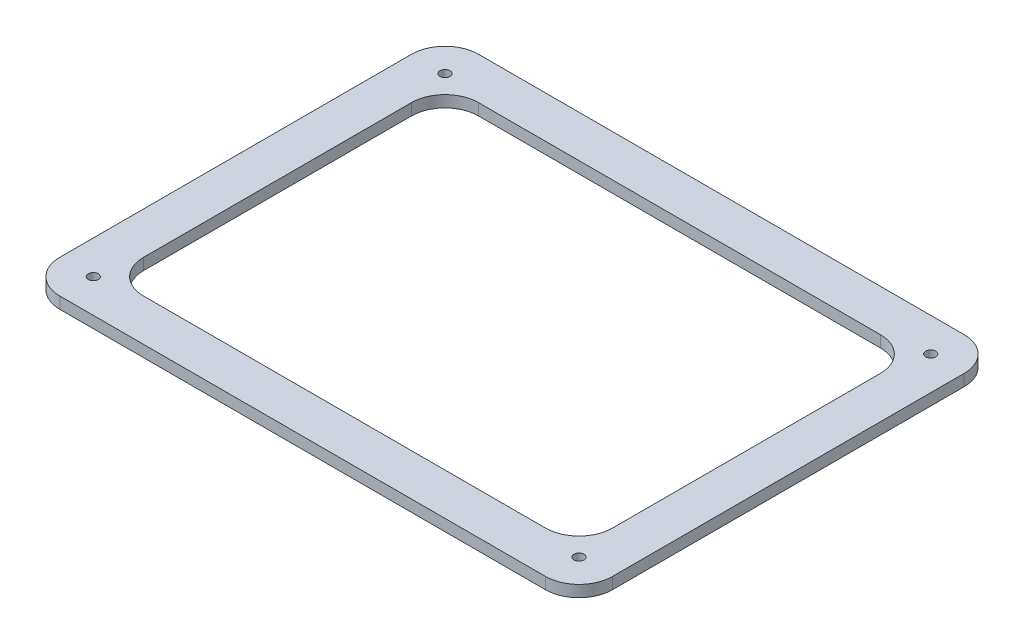
ISO-10303-21;
HEADER;
FILE_DESCRIPTION(('STEP AP214'),'2;1');
FILE_NAME('part.step','',(''),(''),'','','');
FILE_SCHEMA(('AUTOMOTIVE_DESIGN { 1 0 10303 214 1 1 1 1 }'));
ENDSEC;
DATA;
#1=APPLICATION_CONTEXT('core data for automotive mechanical design processes');
#2=APPLICATION_PROTOCOL_DEFINITION('international standard','automotive_design',2000,#1);
#3=PRODUCT_CONTEXT('',#1,'mechanical');
#4=PRODUCT('Part','Part','',(#3));
#5=PRODUCT_RELATED_PRODUCT_CATEGORY('part','',(#4));
#6=PRODUCT_DEFINITION_FORMATION('','',#4);
#7=PRODUCT_DEFINITION_CONTEXT('part definition',#1,'design');
#8=PRODUCT_DEFINITION('design','',#6,#7);
#9=PRODUCT_DEFINITION_SHAPE('','',#8);
#10=(LENGTH_UNIT() NAMED_UNIT(*) SI_UNIT(.MILLI.,.METRE.));
#11=(NAMED_UNIT(*) PLANE_ANGLE_UNIT() SI_UNIT($,.RADIAN.));
#12=(NAMED_UNIT(*) SI_UNIT($,.STERADIAN.) SOLID_ANGLE_UNIT());
#13=UNCERTAINTY_MEASURE_WITH_UNIT(LENGTH_MEASURE(1.E-05),#10,'distance_accuracy_value','');
#14=(GEOMETRIC_REPRESENTATION_CONTEXT(3) GLOBAL_UNCERTAINTY_ASSIGNED_CONTEXT((#13)) GLOBAL_UNIT_ASSIGNED_CONTEXT((#10,
#11,#12)) REPRESENTATION_CONTEXT('',''));
#15=CARTESIAN_POINT('',(0.,0.,0.));
#16=DIRECTION('',(0.,0.,1.));
#17=DIRECTION('',(1.,0.,0.));
#18=AXIS2_PLACEMENT_3D('',#15,#16,#17);
#19=CARTESIAN_POINT('',(-165.,6.9,125.));
#20=DIRECTION('',(1.,0.,0.));
#21=DIRECTION('',(0.,0.,-1.));
#22=AXIS2_PLACEMENT_3D('',#19,#20,#21);
#23=PLANE('',#22);
#24=DIRECTION('',(0.,0.,1.));
#25=VECTOR('',#24,1.);
#26=CARTESIAN_POINT('',(-165.,6.9,125.));
#27=LINE('',#26,#25);
#28=CARTESIAN_POINT('',(-165.,6.9,-105.));
#29=VERTEX_POINT('',#28);
#30=CARTESIAN_POINT('',(-165.,6.9,105.));
#31=VERTEX_POINT('',#30);
#32=EDGE_CURVE('E183',#29,#31,#27,.T.);
#33=ORIENTED_EDGE('',*,*,#32,.F.);
#34=DIRECTION('',(0.,-1.,0.));
#35=VECTOR('',#34,1.);
#36=CARTESIAN_POINT('',(-165.,6.9,-105.));
#37=LINE('',#36,#35);
#38=CARTESIAN_POINT('',(-165.,0.,-105.));
#39=VERTEX_POINT('',#38);
#40=EDGE_CURVE('E224',#29,#39,#37,.T.);
#41=ORIENTED_EDGE('',*,*,#40,.T.);
#42=DIRECTION('',(0.,0.,1.));
#43=VECTOR('',#42,1.);
#44=CARTESIAN_POINT('',(-165.,0.,125.));
#45=LINE('',#44,#43);
#46=CARTESIAN_POINT('',(-165.,0.,105.));
#47=VERTEX_POINT('',#46);
#48=EDGE_CURVE('E355',#39,#47,#45,.T.);
#49=ORIENTED_EDGE('',*,*,#48,.T.);
#50=DIRECTION('',(0.,-1.,0.));
#51=VECTOR('',#50,1.);
#52=CARTESIAN_POINT('',(-165.,6.9,105.));
#53=LINE('',#52,#51);
#54=EDGE_CURVE('E221',#47,#31,#53,.F.);
#55=ORIENTED_EDGE('',*,*,#54,.T.);
#56=EDGE_LOOP('',(#33,#41,#49,#55));
#57=FACE_BOUND('',#56,.T.);
#58=ADVANCED_FACE('F39',(#57),#23,.F.);
#59=CARTESIAN_POINT('',(-165.,6.9,125.));
#60=DIRECTION('',(0.,0.,-1.));
#61=DIRECTION('',(-1.,0.,0.));
#62=AXIS2_PLACEMENT_3D('',#59,#60,#61);
#63=PLANE('',#62);
#64=DIRECTION('',(1.,0.,0.));
#65=VECTOR('',#64,1.);
#66=CARTESIAN_POINT('',(-165.,6.9,125.));
#67=LINE('',#66,#65);
#68=CARTESIAN_POINT('',(-145.,6.9,125.));
#69=VERTEX_POINT('',#68);
#70=CARTESIAN_POINT('',(145.,6.9,125.));
#71=VERTEX_POINT('',#70);
#72=EDGE_CURVE('E189',#69,#71,#67,.T.);
#73=ORIENTED_EDGE('',*,*,#72,.F.);
#74=DIRECTION('',(0.,-1.,0.));
#75=VECTOR('',#74,1.);
#76=CARTESIAN_POINT('',(-145.,6.9,125.));
#77=LINE('',#76,#75);
#78=CARTESIAN_POINT('',(-145.,0.,125.));
#79=VERTEX_POINT('',#78);
#80=EDGE_CURVE('E231',#69,#79,#77,.T.);
#81=ORIENTED_EDGE('',*,*,#80,.T.);
#82=DIRECTION('',(1.,0.,0.));
#83=VECTOR('',#82,1.);
#84=CARTESIAN_POINT('',(-165.,0.,125.));
#85=LINE('',#84,#83);
#86=CARTESIAN_POINT('',(145.,0.,125.));
#87=VERTEX_POINT('',#86);
#88=EDGE_CURVE('E191',#79,#87,#85,.T.);
#89=ORIENTED_EDGE('',*,*,#88,.T.);
#90=DIRECTION('',(0.,-1.,0.));
#91=VECTOR('',#90,1.);
#92=CARTESIAN_POINT('',(145.,6.9,125.));
#93=LINE('',#92,#91);
#94=EDGE_CURVE('E228',#87,#71,#93,.F.);
#95=ORIENTED_EDGE('',*,*,#94,.T.);
#96=EDGE_LOOP('',(#73,#81,#89,#95));
#97=FACE_BOUND('',#96,.T.);
#98=ADVANCED_FACE('F376',(#97),#63,.F.);
#99=CARTESIAN_POINT('',(165.,6.9,125.));
#100=DIRECTION('',(-1.,0.,0.));
#101=DIRECTION('',(0.,0.,1.));
#102=AXIS2_PLACEMENT_3D('',#99,#100,#101);
#103=PLANE('',#102);
#104=DIRECTION('',(0.,0.,-1.));
#105=VECTOR('',#104,1.);
#106=CARTESIAN_POINT('',(165.,0.,125.));
#107=LINE('',#106,#105);
#108=CARTESIAN_POINT('',(165.,0.,105.));
#109=VERTEX_POINT('',#108);
#110=CARTESIAN_POINT('',(165.,0.,-105.));
#111=VERTEX_POINT('',#110);
#112=EDGE_CURVE('E184',#109,#111,#107,.T.);
#113=ORIENTED_EDGE('',*,*,#112,.T.);
#114=DIRECTION('',(0.,-1.,0.));
#115=VECTOR('',#114,1.);
#116=CARTESIAN_POINT('',(165.,6.9,-105.));
#117=LINE('',#116,#115);
#118=CARTESIAN_POINT('',(165.,6.9,-105.));
#119=VERTEX_POINT('',#118);
#120=EDGE_CURVE('E159',#111,#119,#117,.F.);
#121=ORIENTED_EDGE('',*,*,#120,.T.);
#122=DIRECTION('',(0.,0.,-1.));
#123=VECTOR('',#122,1.);
#124=CARTESIAN_POINT('',(165.,6.9,125.));
#125=LINE('',#124,#123);
#126=CARTESIAN_POINT('',(165.,6.9,105.));
#127=VERTEX_POINT('',#126);
#128=EDGE_CURVE('E362',#127,#119,#125,.T.);
#129=ORIENTED_EDGE('',*,*,#128,.F.);
#130=DIRECTION('',(0.,-1.,0.));
#131=VECTOR('',#130,1.);
#132=CARTESIAN_POINT('',(165.,6.9,105.));
#133=LINE('',#132,#131);
#134=EDGE_CURVE('E165',#127,#109,#133,.T.);
#135=ORIENTED_EDGE('',*,*,#134,.T.);
#136=EDGE_LOOP('',(#113,#121,#129,#135));
#137=FACE_BOUND('',#136,.T.);
#138=ADVANCED_FACE('F385',(#137),#103,.F.);
#139=CARTESIAN_POINT('',(-165.,6.9,-125.));
#140=DIRECTION('',(0.,0.,1.));
#141=DIRECTION('',(1.,0.,0.));
#142=AXIS2_PLACEMENT_3D('',#139,#140,#141);
#143=PLANE('',#142);
#144=DIRECTION('',(-1.,0.,0.));
#145=VECTOR('',#144,1.);
#146=CARTESIAN_POINT('',(-165.,6.9,-125.));
#147=LINE('',#146,#145);
#148=CARTESIAN_POINT('',(145.,6.9,-125.));
#149=VERTEX_POINT('',#148);
#150=CARTESIAN_POINT('',(-145.,6.9,-125.));
#151=VERTEX_POINT('',#150);
#152=EDGE_CURVE('E175',#149,#151,#147,.T.);
#153=ORIENTED_EDGE('',*,*,#152,.F.);
#154=DIRECTION('',(0.,-1.,0.));
#155=VECTOR('',#154,1.);
#156=CARTESIAN_POINT('',(145.,6.9,-125.));
#157=LINE('',#156,#155);
#158=CARTESIAN_POINT('',(145.,0.,-125.));
#159=VERTEX_POINT('',#158);
#160=EDGE_CURVE('E158',#149,#159,#157,.T.);
#161=ORIENTED_EDGE('',*,*,#160,.T.);
#162=DIRECTION('',(-1.,0.,0.));
#163=VECTOR('',#162,1.);
#164=CARTESIAN_POINT('',(-165.,0.,-125.));
#165=LINE('',#164,#163);
#166=CARTESIAN_POINT('',(-145.,0.,-125.));
#167=VERTEX_POINT('',#166);
#168=EDGE_CURVE('E172',#159,#167,#165,.T.);
#169=ORIENTED_EDGE('',*,*,#168,.T.);
#170=DIRECTION('',(0.,-1.,0.));
#171=VECTOR('',#170,1.);
#172=CARTESIAN_POINT('',(-145.,6.9,-125.));
#173=LINE('',#172,#171);
#174=EDGE_CURVE('E178',#167,#151,#173,.F.);
#175=ORIENTED_EDGE('',*,*,#174,.T.);
#176=EDGE_LOOP('',(#153,#161,#169,#175));
#177=FACE_BOUND('',#176,.T.);
#178=ADVANCED_FACE('F171',(#177),#143,.F.);
#179=CARTESIAN_POINT('',(0.,6.9,0.));
#180=DIRECTION('',(0.,-1.,0.));
#181=DIRECTION('',(0.,0.,-1.));
#182=AXIS2_PLACEMENT_3D('',#179,#180,#181);
#183=PLANE('',#182);
#184=DIRECTION('',(1.,0.,0.));
#185=VECTOR('',#184,1.);
#186=CARTESIAN_POINT('',(-140.,6.9,100.));
#187=LINE('',#186,#185);
#188=CARTESIAN_POINT('',(-120.,6.9,100.));
#189=VERTEX_POINT('',#188);
#190=CARTESIAN_POINT('',(120.,6.9,100.));
#191=VERTEX_POINT('',#190);
#192=EDGE_CURVE('E320',#189,#191,#187,.T.);
#193=ORIENTED_EDGE('',*,*,#192,.F.);
#194=CARTESIAN_POINT('',(-120.,6.9,80.));
#195=DIRECTION('',(0.,-1.,0.));
#196=DIRECTION('',(0.,0.,-1.));
#197=AXIS2_PLACEMENT_3D('',#194,#195,#196);
#198=CIRCLE('',#197,20.);
#199=CARTESIAN_POINT('',(-140.,6.9,80.));
#200=VERTEX_POINT('',#199);
#201=EDGE_CURVE('E262',#189,#200,#198,.T.);
#202=ORIENTED_EDGE('',*,*,#201,.T.);
#203=DIRECTION('',(0.,0.,1.));
#204=VECTOR('',#203,1.);
#205=CARTESIAN_POINT('',(-140.,6.9,-100.));
#206=LINE('',#205,#204);
#207=CARTESIAN_POINT('',(-140.,6.9,-80.));
#208=VERTEX_POINT('',#207);
#209=EDGE_CURVE('E287',#208,#200,#206,.T.);
#210=ORIENTED_EDGE('',*,*,#209,.F.);
#211=CARTESIAN_POINT('',(-120.,6.9,-80.));
#212=DIRECTION('',(0.,-1.,0.));
#213=DIRECTION('',(0.,0.,-1.));
#214=AXIS2_PLACEMENT_3D('',#211,#212,#213);
#215=CIRCLE('',#214,20.);
#216=CARTESIAN_POINT('',(-120.,6.9,-100.));
#217=VERTEX_POINT('',#216);
#218=EDGE_CURVE('E48',#208,#217,#215,.T.);
#219=ORIENTED_EDGE('',*,*,#218,.T.);
#220=DIRECTION('',(-1.,0.,0.));
#221=VECTOR('',#220,1.);
#222=CARTESIAN_POINT('',(-140.,6.9,-100.));
#223=LINE('',#222,#221);
#224=CARTESIAN_POINT('',(120.,6.9,-100.));
#225=VERTEX_POINT('',#224);
#226=EDGE_CURVE('E285',#225,#217,#223,.T.);
#227=ORIENTED_EDGE('',*,*,#226,.F.);
#228=CARTESIAN_POINT('',(120.,6.9,-80.0000000000001));
#229=DIRECTION('',(0.,-1.,0.));
#230=DIRECTION('',(0.,0.,-1.));
#231=AXIS2_PLACEMENT_3D('',#228,#229,#230);
#232=CIRCLE('',#231,20.);
#233=CARTESIAN_POINT('',(140.,6.9,-80.0000000000001));
#234=VERTEX_POINT('',#233);
#235=EDGE_CURVE('E274',#225,#234,#232,.T.);
#236=ORIENTED_EDGE('',*,*,#235,.T.);
#237=DIRECTION('',(0.,0.,-1.));
#238=VECTOR('',#237,1.);
#239=CARTESIAN_POINT('',(140.,6.9,-100.));
#240=LINE('',#239,#238);
#241=CARTESIAN_POINT('',(140.,6.9,80.));
#242=VERTEX_POINT('',#241);
#243=EDGE_CURVE('E294',#242,#234,#240,.T.);
#244=ORIENTED_EDGE('',*,*,#243,.F.);
#245=CARTESIAN_POINT('',(120.,6.9,80.));
#246=DIRECTION('',(0.,-1.,0.));
#247=DIRECTION('',(0.,0.,-1.));
#248=AXIS2_PLACEMENT_3D('',#245,#246,#247);
#249=CIRCLE('',#248,20.);
#250=EDGE_CURVE('E268',#242,#191,#249,.T.);
#251=ORIENTED_EDGE('',*,*,#250,.T.);
#252=EDGE_LOOP('',(#193,#202,#210,#219,#227,#236,#244,#251));
#253=FACE_BOUND('',#252,.T.);
#254=CARTESIAN_POINT('',(-145.,6.9,105.));
#255=DIRECTION('',(0.,1.,0.));
#256=DIRECTION('',(0.,0.,1.));
#257=AXIS2_PLACEMENT_3D('',#254,#255,#256);
#258=CIRCLE('',#257,2.99999999999999);
#259=CARTESIAN_POINT('',(-145.,6.9,108.));
#260=VERTEX_POINT('',#259);
#261=EDGE_CURVE('E317',#260,#260,#258,.T.);
#262=ORIENTED_EDGE('',*,*,#261,.F.);
#263=EDGE_LOOP('',(#262));
#264=FACE_BOUND('',#263,.T.);
#265=CARTESIAN_POINT('',(145.,6.9,105.));
#266=DIRECTION('',(0.,1.,0.));
#267=DIRECTION('',(0.,0.,1.));
#268=AXIS2_PLACEMENT_3D('',#265,#266,#267);
#269=CIRCLE('',#268,2.99999999999999);
#270=CARTESIAN_POINT('',(145.,6.9,108.));
#271=VERTEX_POINT('',#270);
#272=EDGE_CURVE('E340',#271,#271,#269,.T.);
#273=ORIENTED_EDGE('',*,*,#272,.F.);
#274=EDGE_LOOP('',(#273));
#275=FACE_BOUND('',#274,.T.);
#276=CARTESIAN_POINT('',(145.,6.9,-105.));
#277=DIRECTION('',(0.,1.,0.));
#278=DIRECTION('',(0.,0.,1.));
#279=AXIS2_PLACEMENT_3D('',#276,#277,#278);
#280=CIRCLE('',#279,2.99999999999999);
#281=CARTESIAN_POINT('',(145.,6.9,-102.));
#282=VERTEX_POINT('',#281);
#283=EDGE_CURVE('E332',#282,#282,#280,.T.);
#284=ORIENTED_EDGE('',*,*,#283,.F.);
#285=EDGE_LOOP('',(#284));
#286=FACE_BOUND('',#285,.T.);
#287=CARTESIAN_POINT('',(-145.,6.9,-105.));
#288=DIRECTION('',(0.,1.,0.));
#289=DIRECTION('',(0.,0.,1.));
#290=AXIS2_PLACEMENT_3D('',#287,#288,#289);
#291=CIRCLE('',#290,2.99999999999999);
#292=CARTESIAN_POINT('',(-145.,6.9,-102.));
#293=VERTEX_POINT('',#292);
#294=EDGE_CURVE('E331',#293,#293,#291,.T.);
#295=ORIENTED_EDGE('',*,*,#294,.F.);
#296=EDGE_LOOP('',(#295));
#297=FACE_BOUND('',#296,.T.);
#298=ORIENTED_EDGE('',*,*,#128,.T.);
#299=CARTESIAN_POINT('',(145.,6.9,-105.));
#300=DIRECTION('',(0.,-1.,0.));
#301=DIRECTION('',(0.,0.,-1.));
#302=AXIS2_PLACEMENT_3D('',#299,#300,#301);
#303=CIRCLE('',#302,20.);
#304=EDGE_CURVE('E218',#119,#149,#303,.F.);
#305=ORIENTED_EDGE('',*,*,#304,.T.);
#306=ORIENTED_EDGE('',*,*,#152,.T.);
#307=CARTESIAN_POINT('',(-145.,6.9,-105.));
#308=DIRECTION('',(0.,-1.,0.));
#309=DIRECTION('',(0.,0.,-1.));
#310=AXIS2_PLACEMENT_3D('',#307,#308,#309);
#311=CIRCLE('',#310,20.);
#312=EDGE_CURVE('E215',#151,#29,#311,.F.);
#313=ORIENTED_EDGE('',*,*,#312,.T.);
#314=ORIENTED_EDGE('',*,*,#32,.T.);
#315=CARTESIAN_POINT('',(-145.,6.9,105.));
#316=DIRECTION('',(0.,-1.,0.));
#317=DIRECTION('',(0.,0.,-1.));
#318=AXIS2_PLACEMENT_3D('',#315,#316,#317);
#319=CIRCLE('',#318,20.);
#320=EDGE_CURVE('E212',#31,#69,#319,.F.);
#321=ORIENTED_EDGE('',*,*,#320,.T.);
#322=ORIENTED_EDGE('',*,*,#72,.T.);
#323=CARTESIAN_POINT('',(145.,6.9,105.));
#324=DIRECTION('',(0.,-1.,0.));
#325=DIRECTION('',(0.,0.,-1.));
#326=AXIS2_PLACEMENT_3D('',#323,#324,#325);
#327=CIRCLE('',#326,20.);
#328=EDGE_CURVE('E209',#71,#127,#327,.F.);
#329=ORIENTED_EDGE('',*,*,#328,.T.);
#330=EDGE_LOOP('',(#298,#305,#306,#313,#314,#321,#322,#329));
#331=FACE_BOUND('',#330,.T.);
#332=ADVANCED_FACE('F283',(#253,#264,#275,#286,#297,#331),#183,.F.);
#333=CARTESIAN_POINT('',(0.,0.,0.));
#334=DIRECTION('',(0.,-1.,0.));
#335=DIRECTION('',(0.,0.,-1.));
#336=AXIS2_PLACEMENT_3D('',#333,#334,#335);
#337=PLANE('',#336);
#338=DIRECTION('',(-1.,0.,0.));
#339=VECTOR('',#338,1.);
#340=CARTESIAN_POINT('',(-140.,0.,-100.));
#341=LINE('',#340,#339);
#342=CARTESIAN_POINT('',(120.,0.,-100.));
#343=VERTEX_POINT('',#342);
#344=CARTESIAN_POINT('',(-120.,0.,-100.));
#345=VERTEX_POINT('',#344);
#346=EDGE_CURVE('E301',#343,#345,#341,.T.);
#347=ORIENTED_EDGE('',*,*,#346,.T.);
#348=CARTESIAN_POINT('',(-120.,0.,-80.));
#349=DIRECTION('',(0.,-1.,0.));
#350=DIRECTION('',(0.,0.,-1.));
#351=AXIS2_PLACEMENT_3D('',#348,#349,#350);
#352=CIRCLE('',#351,20.);
#353=CARTESIAN_POINT('',(-140.,0.,-80.));
#354=VERTEX_POINT('',#353);
#355=EDGE_CURVE('E11',#345,#354,#352,.F.);
#356=ORIENTED_EDGE('',*,*,#355,.T.);
#357=DIRECTION('',(0.,0.,1.));
#358=VECTOR('',#357,1.);
#359=CARTESIAN_POINT('',(-140.,0.,-100.));
#360=LINE('',#359,#358);
#361=CARTESIAN_POINT('',(-140.,0.,80.));
#362=VERTEX_POINT('',#361);
#363=EDGE_CURVE('E293',#354,#362,#360,.T.);
#364=ORIENTED_EDGE('',*,*,#363,.T.);
#365=CARTESIAN_POINT('',(-120.,0.,80.));
#366=DIRECTION('',(0.,-1.,0.));
#367=DIRECTION('',(0.,0.,-1.));
#368=AXIS2_PLACEMENT_3D('',#365,#366,#367);
#369=CIRCLE('',#368,20.);
#370=CARTESIAN_POINT('',(-120.,0.,100.));
#371=VERTEX_POINT('',#370);
#372=EDGE_CURVE('E265',#362,#371,#369,.F.);
#373=ORIENTED_EDGE('',*,*,#372,.T.);
#374=DIRECTION('',(1.,0.,0.));
#375=VECTOR('',#374,1.);
#376=CARTESIAN_POINT('',(-140.,0.,100.));
#377=LINE('',#376,#375);
#378=CARTESIAN_POINT('',(120.,0.,100.));
#379=VERTEX_POINT('',#378);
#380=EDGE_CURVE('E306',#371,#379,#377,.T.);
#381=ORIENTED_EDGE('',*,*,#380,.T.);
#382=CARTESIAN_POINT('',(120.,0.,80.));
#383=DIRECTION('',(0.,-1.,0.));
#384=DIRECTION('',(0.,0.,-1.));
#385=AXIS2_PLACEMENT_3D('',#382,#383,#384);
#386=CIRCLE('',#385,20.);
#387=CARTESIAN_POINT('',(140.,0.,80.));
#388=VERTEX_POINT('',#387);
#389=EDGE_CURVE('E271',#379,#388,#386,.F.);
#390=ORIENTED_EDGE('',*,*,#389,.T.);
#391=DIRECTION('',(0.,0.,-1.));
#392=VECTOR('',#391,1.);
#393=CARTESIAN_POINT('',(140.,0.,-100.));
#394=LINE('',#393,#392);
#395=CARTESIAN_POINT('',(140.,0.,-80.0000000000001));
#396=VERTEX_POINT('',#395);
#397=EDGE_CURVE('E310',#388,#396,#394,.T.);
#398=ORIENTED_EDGE('',*,*,#397,.T.);
#399=CARTESIAN_POINT('',(120.,0.,-80.0000000000001));
#400=DIRECTION('',(0.,-1.,0.));
#401=DIRECTION('',(0.,0.,-1.));
#402=AXIS2_PLACEMENT_3D('',#399,#400,#401);
#403=CIRCLE('',#402,20.);
#404=EDGE_CURVE('E62',#396,#343,#403,.F.);
#405=ORIENTED_EDGE('',*,*,#404,.T.);
#406=EDGE_LOOP('',(#347,#356,#364,#373,#381,#390,#398,#405));
#407=FACE_BOUND('',#406,.T.);
#408=CARTESIAN_POINT('',(-145.,0.,105.));
#409=DIRECTION('',(0.,1.,0.));
#410=DIRECTION('',(0.,0.,1.));
#411=AXIS2_PLACEMENT_3D('',#408,#409,#410);
#412=CIRCLE('',#411,2.99999999999999);
#413=CARTESIAN_POINT('',(-145.,0.,108.));
#414=VERTEX_POINT('',#413);
#415=EDGE_CURVE('E344',#414,#414,#412,.T.);
#416=ORIENTED_EDGE('',*,*,#415,.T.);
#417=EDGE_LOOP('',(#416));
#418=FACE_BOUND('',#417,.T.);
#419=CARTESIAN_POINT('',(145.,0.,105.));
#420=DIRECTION('',(0.,1.,0.));
#421=DIRECTION('',(0.,0.,1.));
#422=AXIS2_PLACEMENT_3D('',#419,#420,#421);
#423=CIRCLE('',#422,2.99999999999999);
#424=CARTESIAN_POINT('',(145.,0.,108.));
#425=VERTEX_POINT('',#424);
#426=EDGE_CURVE('E336',#425,#425,#423,.T.);
#427=ORIENTED_EDGE('',*,*,#426,.T.);
#428=EDGE_LOOP('',(#427));
#429=FACE_BOUND('',#428,.T.);
#430=CARTESIAN_POINT('',(145.,0.,-105.));
#431=DIRECTION('',(0.,1.,0.));
#432=DIRECTION('',(0.,0.,1.));
#433=AXIS2_PLACEMENT_3D('',#430,#431,#432);
#434=CIRCLE('',#433,2.99999999999999);
#435=CARTESIAN_POINT('',(145.,0.,-102.));
#436=VERTEX_POINT('',#435);
#437=EDGE_CURVE('E327',#436,#436,#434,.T.);
#438=ORIENTED_EDGE('',*,*,#437,.T.);
#439=EDGE_LOOP('',(#438));
#440=FACE_BOUND('',#439,.T.);
#441=CARTESIAN_POINT('',(-145.,0.,-105.));
#442=DIRECTION('',(0.,1.,0.));
#443=DIRECTION('',(0.,0.,1.));
#444=AXIS2_PLACEMENT_3D('',#441,#442,#443);
#445=CIRCLE('',#444,2.99999999999999);
#446=CARTESIAN_POINT('',(-145.,0.,-102.));
#447=VERTEX_POINT('',#446);
#448=EDGE_CURVE('E351',#447,#447,#445,.T.);
#449=ORIENTED_EDGE('',*,*,#448,.T.);
#450=EDGE_LOOP('',(#449));
#451=FACE_BOUND('',#450,.T.);
#452=ORIENTED_EDGE('',*,*,#168,.F.);
#453=CARTESIAN_POINT('',(145.,0.,-105.));
#454=DIRECTION('',(0.,-1.,0.));
#455=DIRECTION('',(0.,0.,-1.));
#456=AXIS2_PLACEMENT_3D('',#453,#454,#455);
#457=CIRCLE('',#456,20.);
#458=EDGE_CURVE('E154',#159,#111,#457,.T.);
#459=ORIENTED_EDGE('',*,*,#458,.T.);
#460=ORIENTED_EDGE('',*,*,#112,.F.);
#461=CARTESIAN_POINT('',(145.,0.,105.));
#462=DIRECTION('',(0.,-1.,0.));
#463=DIRECTION('',(0.,0.,-1.));
#464=AXIS2_PLACEMENT_3D('',#461,#462,#463);
#465=CIRCLE('',#464,20.);
#466=EDGE_CURVE('E177',#109,#87,#465,.T.);
#467=ORIENTED_EDGE('',*,*,#466,.T.);
#468=ORIENTED_EDGE('',*,*,#88,.F.);
#469=CARTESIAN_POINT('',(-145.,0.,105.));
#470=DIRECTION('',(0.,-1.,0.));
#471=DIRECTION('',(0.,0.,-1.));
#472=AXIS2_PLACEMENT_3D('',#469,#470,#471);
#473=CIRCLE('',#472,20.);
#474=EDGE_CURVE('E199',#79,#47,#473,.T.);
#475=ORIENTED_EDGE('',*,*,#474,.T.);
#476=ORIENTED_EDGE('',*,*,#48,.F.);
#477=CARTESIAN_POINT('',(-145.,0.,-105.));
#478=DIRECTION('',(0.,-1.,0.));
#479=DIRECTION('',(0.,0.,-1.));
#480=AXIS2_PLACEMENT_3D('',#477,#478,#479);
#481=CIRCLE('',#480,20.);
#482=EDGE_CURVE('E166',#39,#167,#481,.T.);
#483=ORIENTED_EDGE('',*,*,#482,.T.);
#484=EDGE_LOOP('',(#452,#459,#460,#467,#468,#475,#476,#483));
#485=FACE_BOUND('',#484,.T.);
#486=ADVANCED_FACE('F180',(#407,#418,#429,#440,#451,#485),#337,.T.);
#487=CARTESIAN_POINT('',(-145.,0.,-105.));
#488=DIRECTION('',(0.,1.,0.));
#489=DIRECTION('',(0.,0.,1.));
#490=AXIS2_PLACEMENT_3D('',#487,#488,#489);
#491=CYLINDRICAL_SURFACE('',#490,2.99999999999999);
#492=ORIENTED_EDGE('',*,*,#448,.F.);
#493=EDGE_LOOP('',(#492));
#494=FACE_BOUND('',#493,.T.);
#495=ORIENTED_EDGE('',*,*,#294,.T.);
#496=EDGE_LOOP('',(#495));
#497=FACE_BOUND('',#496,.T.);
#498=ADVANCED_FACE('F453',(#494,#497),#491,.F.);
#499=CARTESIAN_POINT('',(145.,0.,-105.));
#500=DIRECTION('',(0.,1.,0.));
#501=DIRECTION('',(0.,0.,1.));
#502=AXIS2_PLACEMENT_3D('',#499,#500,#501);
#503=CYLINDRICAL_SURFACE('',#502,2.99999999999999);
#504=ORIENTED_EDGE('',*,*,#437,.F.);
#505=EDGE_LOOP('',(#504));
#506=FACE_BOUND('',#505,.T.);
#507=ORIENTED_EDGE('',*,*,#283,.T.);
#508=EDGE_LOOP('',(#507));
#509=FACE_BOUND('',#508,.T.);
#510=ADVANCED_FACE('F449',(#506,#509),#503,.F.);
#511=CARTESIAN_POINT('',(145.,0.,105.));
#512=DIRECTION('',(0.,1.,0.));
#513=DIRECTION('',(0.,0.,1.));
#514=AXIS2_PLACEMENT_3D('',#511,#512,#513);
#515=CYLINDRICAL_SURFACE('',#514,2.99999999999999);
#516=ORIENTED_EDGE('',*,*,#426,.F.);
#517=EDGE_LOOP('',(#516));
#518=FACE_BOUND('',#517,.T.);
#519=ORIENTED_EDGE('',*,*,#272,.T.);
#520=EDGE_LOOP('',(#519));
#521=FACE_BOUND('',#520,.T.);
#522=ADVANCED_FACE('F452',(#518,#521),#515,.F.);
#523=CARTESIAN_POINT('',(-145.,0.,105.));
#524=DIRECTION('',(0.,1.,0.));
#525=DIRECTION('',(0.,0.,1.));
#526=AXIS2_PLACEMENT_3D('',#523,#524,#525);
#527=CYLINDRICAL_SURFACE('',#526,2.99999999999999);
#528=ORIENTED_EDGE('',*,*,#415,.F.);
#529=EDGE_LOOP('',(#528));
#530=FACE_BOUND('',#529,.T.);
#531=ORIENTED_EDGE('',*,*,#261,.T.);
#532=EDGE_LOOP('',(#531));
#533=FACE_BOUND('',#532,.T.);
#534=ADVANCED_FACE('F448',(#530,#533),#527,.F.);
#535=CARTESIAN_POINT('',(-140.,0.,-100.));
#536=DIRECTION('',(-1.,0.,0.));
#537=DIRECTION('',(0.,0.,1.));
#538=AXIS2_PLACEMENT_3D('',#535,#536,#537);
#539=PLANE('',#538);
#540=ORIENTED_EDGE('',*,*,#209,.T.);
#541=DIRECTION('',(0.,1.,0.));
#542=VECTOR('',#541,1.);
#543=CARTESIAN_POINT('',(-140.,0.,80.));
#544=LINE('',#543,#542);
#545=EDGE_CURVE('E246',#200,#362,#544,.F.);
#546=ORIENTED_EDGE('',*,*,#545,.T.);
#547=ORIENTED_EDGE('',*,*,#363,.F.);
#548=DIRECTION('',(0.,1.,0.));
#549=VECTOR('',#548,1.);
#550=CARTESIAN_POINT('',(-140.,6.9,-80.));
#551=LINE('',#550,#549);
#552=EDGE_CURVE('E242',#354,#208,#551,.T.);
#553=ORIENTED_EDGE('',*,*,#552,.T.);
#554=EDGE_LOOP('',(#540,#546,#547,#553));
#555=FACE_BOUND('',#554,.T.);
#556=ADVANCED_FACE('F303',(#555),#539,.F.);
#557=CARTESIAN_POINT('',(-140.,0.,-100.));
#558=DIRECTION('',(0.,0.,-1.));
#559=DIRECTION('',(-1.,0.,0.));
#560=AXIS2_PLACEMENT_3D('',#557,#558,#559);
#561=PLANE('',#560);
#562=ORIENTED_EDGE('',*,*,#346,.F.);
#563=DIRECTION('',(0.,1.,0.));
#564=VECTOR('',#563,1.);
#565=CARTESIAN_POINT('',(120.,6.9,-100.));
#566=LINE('',#565,#564);
#567=EDGE_CURVE('E258',#343,#225,#566,.T.);
#568=ORIENTED_EDGE('',*,*,#567,.T.);
#569=ORIENTED_EDGE('',*,*,#226,.T.);
#570=DIRECTION('',(0.,1.,0.));
#571=VECTOR('',#570,1.);
#572=CARTESIAN_POINT('',(-120.,0.,-100.));
#573=LINE('',#572,#571);
#574=EDGE_CURVE('E55',#217,#345,#573,.F.);
#575=ORIENTED_EDGE('',*,*,#574,.T.);
#576=EDGE_LOOP('',(#562,#568,#569,#575));
#577=FACE_BOUND('',#576,.T.);
#578=ADVANCED_FACE('F290',(#577),#561,.F.);
#579=CARTESIAN_POINT('',(140.,0.,-100.));
#580=DIRECTION('',(1.,0.,0.));
#581=DIRECTION('',(0.,0.,-1.));
#582=AXIS2_PLACEMENT_3D('',#579,#580,#581);
#583=PLANE('',#582);
#584=ORIENTED_EDGE('',*,*,#397,.F.);
#585=DIRECTION('',(0.,1.,0.));
#586=VECTOR('',#585,1.);
#587=CARTESIAN_POINT('',(140.,6.9,80.));
#588=LINE('',#587,#586);
#589=EDGE_CURVE('E252',#388,#242,#588,.T.);
#590=ORIENTED_EDGE('',*,*,#589,.T.);
#591=ORIENTED_EDGE('',*,*,#243,.T.);
#592=DIRECTION('',(0.,1.,0.));
#593=VECTOR('',#592,1.);
#594=CARTESIAN_POINT('',(140.,0.,-80.0000000000001));
#595=LINE('',#594,#593);
#596=EDGE_CURVE('E249',#234,#396,#595,.F.);
#597=ORIENTED_EDGE('',*,*,#596,.T.);
#598=EDGE_LOOP('',(#584,#590,#591,#597));
#599=FACE_BOUND('',#598,.T.);
#600=ADVANCED_FACE('F431',(#599),#583,.F.);
#601=CARTESIAN_POINT('',(-140.,0.,100.));
#602=DIRECTION('',(0.,0.,1.));
#603=DIRECTION('',(1.,0.,0.));
#604=AXIS2_PLACEMENT_3D('',#601,#602,#603);
#605=PLANE('',#604);
#606=ORIENTED_EDGE('',*,*,#380,.F.);
#607=DIRECTION('',(0.,1.,0.));
#608=VECTOR('',#607,1.);
#609=CARTESIAN_POINT('',(-120.,6.9,100.));
#610=LINE('',#609,#608);
#611=EDGE_CURVE('E238',#371,#189,#610,.T.);
#612=ORIENTED_EDGE('',*,*,#611,.T.);
#613=ORIENTED_EDGE('',*,*,#192,.T.);
#614=DIRECTION('',(0.,1.,0.));
#615=VECTOR('',#614,1.);
#616=CARTESIAN_POINT('',(120.,0.,100.));
#617=LINE('',#616,#615);
#618=EDGE_CURVE('E235',#191,#379,#617,.F.);
#619=ORIENTED_EDGE('',*,*,#618,.T.);
#620=EDGE_LOOP('',(#606,#612,#613,#619));
#621=FACE_BOUND('',#620,.T.);
#622=ADVANCED_FACE('F404',(#621),#605,.F.);
#623=CARTESIAN_POINT('',(145.,6.9,-105.));
#624=DIRECTION('',(0.,-1.,0.));
#625=DIRECTION('',(0.,0.,-1.));
#626=AXIS2_PLACEMENT_3D('',#623,#624,#625);
#627=CYLINDRICAL_SURFACE('',#626,20.);
#628=ORIENTED_EDGE('',*,*,#304,.F.);
#629=ORIENTED_EDGE('',*,*,#120,.F.);
#630=ORIENTED_EDGE('',*,*,#458,.F.);
#631=ORIENTED_EDGE('',*,*,#160,.F.);
#632=EDGE_LOOP('',(#628,#629,#630,#631));
#633=FACE_BOUND('',#632,.T.);
#634=ADVANCED_FACE('F157',(#633),#627,.T.);
#635=CARTESIAN_POINT('',(-145.,6.9,-105.));
#636=DIRECTION('',(0.,-1.,0.));
#637=DIRECTION('',(0.,0.,-1.));
#638=AXIS2_PLACEMENT_3D('',#635,#636,#637);
#639=CYLINDRICAL_SURFACE('',#638,20.);
#640=ORIENTED_EDGE('',*,*,#312,.F.);
#641=ORIENTED_EDGE('',*,*,#174,.F.);
#642=ORIENTED_EDGE('',*,*,#482,.F.);
#643=ORIENTED_EDGE('',*,*,#40,.F.);
#644=EDGE_LOOP('',(#640,#641,#642,#643));
#645=FACE_BOUND('',#644,.T.);
#646=ADVANCED_FACE('F403',(#645),#639,.T.);
#647=CARTESIAN_POINT('',(-145.,6.9,105.));
#648=DIRECTION('',(0.,-1.,0.));
#649=DIRECTION('',(0.,0.,-1.));
#650=AXIS2_PLACEMENT_3D('',#647,#648,#649);
#651=CYLINDRICAL_SURFACE('',#650,20.);
#652=ORIENTED_EDGE('',*,*,#320,.F.);
#653=ORIENTED_EDGE('',*,*,#54,.F.);
#654=ORIENTED_EDGE('',*,*,#474,.F.);
#655=ORIENTED_EDGE('',*,*,#80,.F.);
#656=EDGE_LOOP('',(#652,#653,#654,#655));
#657=FACE_BOUND('',#656,.T.);
#658=ADVANCED_FACE('F407',(#657),#651,.T.);
#659=CARTESIAN_POINT('',(145.,6.9,105.));
#660=DIRECTION('',(0.,-1.,0.));
#661=DIRECTION('',(0.,0.,-1.));
#662=AXIS2_PLACEMENT_3D('',#659,#660,#661);
#663=CYLINDRICAL_SURFACE('',#662,20.);
#664=ORIENTED_EDGE('',*,*,#328,.F.);
#665=ORIENTED_EDGE('',*,*,#94,.F.);
#666=ORIENTED_EDGE('',*,*,#466,.F.);
#667=ORIENTED_EDGE('',*,*,#134,.F.);
#668=EDGE_LOOP('',(#664,#665,#666,#667));
#669=FACE_BOUND('',#668,.T.);
#670=ADVANCED_FACE('F380',(#669),#663,.T.);
#671=CARTESIAN_POINT('',(-120.,0.,80.));
#672=DIRECTION('',(0.,-1.,0.));
#673=DIRECTION('',(0.,0.,-1.));
#674=AXIS2_PLACEMENT_3D('',#671,#672,#673);
#675=CYLINDRICAL_SURFACE('',#674,20.);
#676=ORIENTED_EDGE('',*,*,#372,.F.);
#677=ORIENTED_EDGE('',*,*,#545,.F.);
#678=ORIENTED_EDGE('',*,*,#201,.F.);
#679=ORIENTED_EDGE('',*,*,#611,.F.);
#680=EDGE_LOOP('',(#676,#677,#678,#679));
#681=FACE_BOUND('',#680,.T.);
#682=ADVANCED_FACE('F414',(#681),#675,.F.);
#683=CARTESIAN_POINT('',(120.,0.,80.));
#684=DIRECTION('',(0.,-1.,0.));
#685=DIRECTION('',(0.,0.,-1.));
#686=AXIS2_PLACEMENT_3D('',#683,#684,#685);
#687=CYLINDRICAL_SURFACE('',#686,20.);
#688=ORIENTED_EDGE('',*,*,#389,.F.);
#689=ORIENTED_EDGE('',*,*,#618,.F.);
#690=ORIENTED_EDGE('',*,*,#250,.F.);
#691=ORIENTED_EDGE('',*,*,#589,.F.);
#692=EDGE_LOOP('',(#688,#689,#690,#691));
#693=FACE_BOUND('',#692,.T.);
#694=ADVANCED_FACE('F417',(#693),#687,.F.);
#695=CARTESIAN_POINT('',(120.,0.,-80.0000000000001));
#696=DIRECTION('',(0.,-1.,0.));
#697=DIRECTION('',(0.,0.,-1.));
#698=AXIS2_PLACEMENT_3D('',#695,#696,#697);
#699=CYLINDRICAL_SURFACE('',#698,20.);
#700=ORIENTED_EDGE('',*,*,#404,.F.);
#701=ORIENTED_EDGE('',*,*,#596,.F.);
#702=ORIENTED_EDGE('',*,*,#235,.F.);
#703=ORIENTED_EDGE('',*,*,#567,.F.);
#704=EDGE_LOOP('',(#700,#701,#702,#703));
#705=FACE_BOUND('',#704,.T.);
#706=ADVANCED_FACE('F420',(#705),#699,.F.);
#707=CARTESIAN_POINT('',(-120.,0.,-80.));
#708=DIRECTION('',(0.,-1.,0.));
#709=DIRECTION('',(0.,0.,-1.));
#710=AXIS2_PLACEMENT_3D('',#707,#708,#709);
#711=CYLINDRICAL_SURFACE('',#710,20.);
#712=ORIENTED_EDGE('',*,*,#355,.F.);
#713=ORIENTED_EDGE('',*,*,#574,.F.);
#714=ORIENTED_EDGE('',*,*,#218,.F.);
#715=ORIENTED_EDGE('',*,*,#552,.F.);
#716=EDGE_LOOP('',(#712,#713,#714,#715));
#717=FACE_BOUND('',#716,.T.);
#718=ADVANCED_FACE('F41',(#717),#711,.F.);
#719=CLOSED_SHELL('',(#58,#98,#138,#178,#332,#486,#498,#510,#522,#534,#556,#578,#600,#622,#634,
#646,#658,#670,#682,#694,#706,#718));
#720=MANIFOLD_SOLID_BREP('B2',#719);
#721=ADVANCED_BREP_SHAPE_REPRESENTATION('',(#18,#720),#14);
#722=SHAPE_DEFINITION_REPRESENTATION(#9,#721);
ENDSEC;
END-ISO-10303-21;
